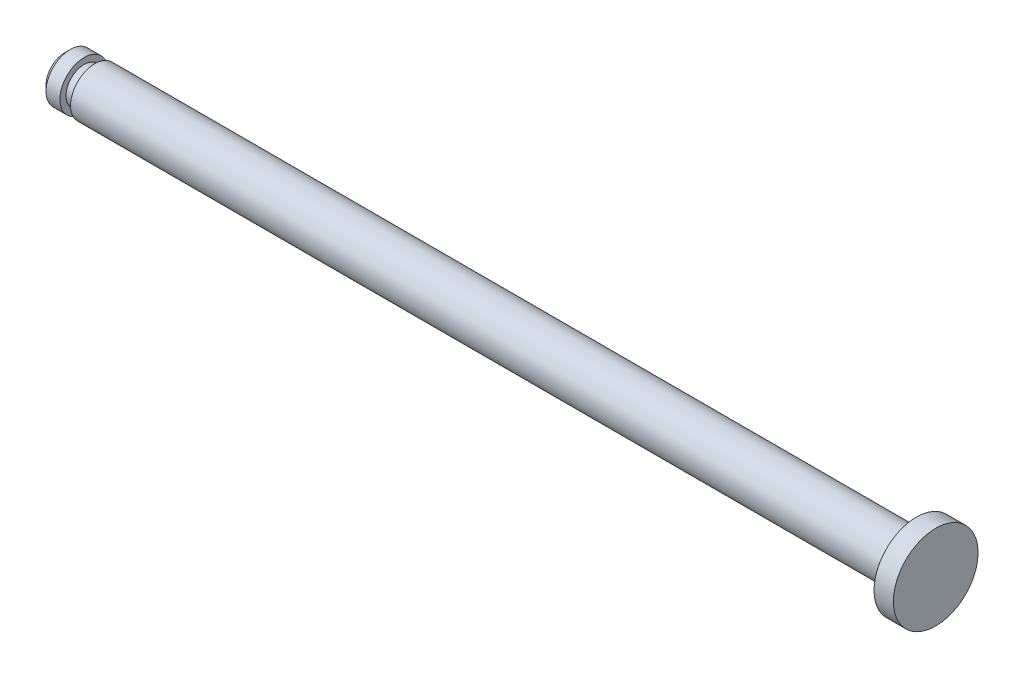
ISO-10303-21;
HEADER;
FILE_DESCRIPTION(('STEP AP214'),'2;1');
FILE_NAME('part.step','',(''),(''),'','','');
FILE_SCHEMA(('AUTOMOTIVE_DESIGN { 1 0 10303 214 1 1 1 1 }'));
ENDSEC;
DATA;
#1=APPLICATION_CONTEXT('core data for automotive mechanical design processes');
#2=APPLICATION_PROTOCOL_DEFINITION('international standard','automotive_design',2000,#1);
#3=PRODUCT_CONTEXT('',#1,'mechanical');
#4=PRODUCT('Part','Part','',(#3));
#5=PRODUCT_RELATED_PRODUCT_CATEGORY('part','',(#4));
#6=PRODUCT_DEFINITION_FORMATION('','',#4);
#7=PRODUCT_DEFINITION_CONTEXT('part definition',#1,'design');
#8=PRODUCT_DEFINITION('design','',#6,#7);
#9=PRODUCT_DEFINITION_SHAPE('','',#8);
#10=(LENGTH_UNIT() NAMED_UNIT(*) SI_UNIT(.MILLI.,.METRE.));
#11=(NAMED_UNIT(*) PLANE_ANGLE_UNIT() SI_UNIT($,.RADIAN.));
#12=(NAMED_UNIT(*) SI_UNIT($,.STERADIAN.) SOLID_ANGLE_UNIT());
#13=UNCERTAINTY_MEASURE_WITH_UNIT(LENGTH_MEASURE(1.E-05),#10,'distance_accuracy_value','');
#14=(GEOMETRIC_REPRESENTATION_CONTEXT(3) GLOBAL_UNCERTAINTY_ASSIGNED_CONTEXT((#13)) GLOBAL_UNIT_ASSIGNED_CONTEXT((#10,
#11,#12)) REPRESENTATION_CONTEXT('',''));
#15=CARTESIAN_POINT('',(0.,0.,0.));
#16=DIRECTION('',(0.,0.,1.));
#17=DIRECTION('',(1.,0.,0.));
#18=AXIS2_PLACEMENT_3D('',#15,#16,#17);
#19=CARTESIAN_POINT('',(-36.,0.,0.));
#20=DIRECTION('',(1.,0.,0.));
#21=DIRECTION('',(0.,0.,-1.));
#22=AXIS2_PLACEMENT_3D('',#19,#20,#21);
#23=PLANE('',#22);
#24=CARTESIAN_POINT('',(-36.,0.,0.));
#25=DIRECTION('',(-1.,0.,0.));
#26=DIRECTION('',(0.,0.,1.));
#27=AXIS2_PLACEMENT_3D('',#24,#25,#26);
#28=CIRCLE('',#27,0.77527582552831);
#29=CARTESIAN_POINT('',(-36.,0.,0.77527582552831));
#30=VERTEX_POINT('',#29);
#31=EDGE_CURVE('E10',#30,#30,#28,.T.);
#32=ORIENTED_EDGE('',*,*,#31,.T.);
#33=EDGE_LOOP('',(#32));
#34=FACE_BOUND('',#33,.T.);
#35=ADVANCED_FACE('F32',(#34),#23,.F.);
#36=CARTESIAN_POINT('',(-35.7752758255283,0.,0.));
#37=DIRECTION('',(1.,0.,0.));
#38=DIRECTION('',(0.,0.,-1.));
#39=AXIS2_PLACEMENT_3D('',#36,#37,#38);
#40=CONICAL_SURFACE('',#39,1.,0.785398163397464);
#41=ORIENTED_EDGE('',*,*,#31,.F.);
#42=EDGE_LOOP('',(#41));
#43=FACE_BOUND('',#42,.T.);
#44=CARTESIAN_POINT('',(-35.7752758255283,0.,0.));
#45=DIRECTION('',(-1.,0.,0.));
#46=DIRECTION('',(0.,0.,1.));
#47=AXIS2_PLACEMENT_3D('',#44,#45,#46);
#48=CIRCLE('',#47,1.);
#49=CARTESIAN_POINT('',(-35.7752758255283,0.,1.));
#50=VERTEX_POINT('',#49);
#51=EDGE_CURVE('E38',#50,#50,#48,.T.);
#52=ORIENTED_EDGE('',*,*,#51,.T.);
#53=EDGE_LOOP('',(#52));
#54=FACE_BOUND('',#53,.T.);
#55=ADVANCED_FACE('F79',(#43,#54),#40,.T.);
#56=CARTESIAN_POINT('',(-40.2814862387044,0.,0.));
#57=DIRECTION('',(-1.,0.,0.));
#58=DIRECTION('',(0.,0.,1.));
#59=AXIS2_PLACEMENT_3D('',#56,#57,#58);
#60=CYLINDRICAL_SURFACE('',#59,1.);
#61=ORIENTED_EDGE('',*,*,#51,.F.);
#62=EDGE_LOOP('',(#61));
#63=FACE_BOUND('',#62,.T.);
#64=CARTESIAN_POINT('',(-35.2,0.,0.));
#65=DIRECTION('',(-1.,0.,0.));
#66=DIRECTION('',(0.,0.,1.));
#67=AXIS2_PLACEMENT_3D('',#64,#65,#66);
#68=CIRCLE('',#67,1.);
#69=CARTESIAN_POINT('',(-35.2,0.,1.));
#70=VERTEX_POINT('',#69);
#71=EDGE_CURVE('E42',#70,#70,#68,.T.);
#72=ORIENTED_EDGE('',*,*,#71,.T.);
#73=EDGE_LOOP('',(#72));
#74=FACE_BOUND('',#73,.T.);
#75=ADVANCED_FACE('F83',(#63,#74),#60,.T.);
#76=CARTESIAN_POINT('',(-35.2,1.,0.));
#77=DIRECTION('',(-1.,0.,0.));
#78=DIRECTION('',(0.,0.,1.));
#79=AXIS2_PLACEMENT_3D('',#76,#77,#78);
#80=PLANE('',#79);
#81=ORIENTED_EDGE('',*,*,#71,.F.);
#82=EDGE_LOOP('',(#81));
#83=FACE_BOUND('',#82,.T.);
#84=CARTESIAN_POINT('',(-35.2,0.,0.));
#85=DIRECTION('',(-1.,0.,0.));
#86=DIRECTION('',(0.,0.,1.));
#87=AXIS2_PLACEMENT_3D('',#84,#85,#86);
#88=CIRCLE('',#87,0.75);
#89=CARTESIAN_POINT('',(-35.2,0.,0.75));
#90=VERTEX_POINT('',#89);
#91=EDGE_CURVE('E46',#90,#90,#88,.T.);
#92=ORIENTED_EDGE('',*,*,#91,.T.);
#93=EDGE_LOOP('',(#92));
#94=FACE_BOUND('',#93,.T.);
#95=ADVANCED_FACE('F88',(#83,#94),#80,.F.);
#96=CARTESIAN_POINT('',(-40.2814862387044,0.,0.));
#97=DIRECTION('',(-1.,0.,0.));
#98=DIRECTION('',(0.,0.,1.));
#99=AXIS2_PLACEMENT_3D('',#96,#97,#98);
#100=CYLINDRICAL_SURFACE('',#99,0.75);
#101=ORIENTED_EDGE('',*,*,#91,.F.);
#102=EDGE_LOOP('',(#101));
#103=FACE_BOUND('',#102,.T.);
#104=CARTESIAN_POINT('',(-34.76,0.,0.));
#105=DIRECTION('',(-1.,0.,0.));
#106=DIRECTION('',(0.,0.,1.));
#107=AXIS2_PLACEMENT_3D('',#104,#105,#106);
#108=CIRCLE('',#107,0.75);
#109=CARTESIAN_POINT('',(-34.76,0.,0.75));
#110=VERTEX_POINT('',#109);
#111=EDGE_CURVE('E51',#110,#110,#108,.T.);
#112=ORIENTED_EDGE('',*,*,#111,.T.);
#113=EDGE_LOOP('',(#112));
#114=FACE_BOUND('',#113,.T.);
#115=ADVANCED_FACE('F94',(#103,#114),#100,.T.);
#116=CARTESIAN_POINT('',(-34.76,0.75,0.));
#117=DIRECTION('',(1.,0.,0.));
#118=DIRECTION('',(0.,0.,-1.));
#119=AXIS2_PLACEMENT_3D('',#116,#117,#118);
#120=PLANE('',#119);
#121=ORIENTED_EDGE('',*,*,#111,.F.);
#122=EDGE_LOOP('',(#121));
#123=FACE_BOUND('',#122,.T.);
#124=CARTESIAN_POINT('',(-34.76,0.,0.));
#125=DIRECTION('',(-1.,0.,0.));
#126=DIRECTION('',(0.,0.,1.));
#127=AXIS2_PLACEMENT_3D('',#124,#125,#126);
#128=CIRCLE('',#127,1.);
#129=CARTESIAN_POINT('',(-34.76,0.,1.));
#130=VERTEX_POINT('',#129);
#131=EDGE_CURVE('E54',#130,#130,#128,.T.);
#132=ORIENTED_EDGE('',*,*,#131,.T.);
#133=EDGE_LOOP('',(#132));
#134=FACE_BOUND('',#133,.T.);
#135=ADVANCED_FACE('F98',(#123,#134),#120,.F.);
#136=CARTESIAN_POINT('',(-40.2814862387044,0.,0.));
#137=DIRECTION('',(-1.,0.,0.));
#138=DIRECTION('',(0.,0.,1.));
#139=AXIS2_PLACEMENT_3D('',#136,#137,#138);
#140=CYLINDRICAL_SURFACE('',#139,1.);
#141=ORIENTED_EDGE('',*,*,#131,.F.);
#142=EDGE_LOOP('',(#141));
#143=FACE_BOUND('',#142,.T.);
#144=CARTESIAN_POINT('',(-0.800000000000002,0.,0.));
#145=DIRECTION('',(-1.,0.,0.));
#146=DIRECTION('',(0.,0.,1.));
#147=AXIS2_PLACEMENT_3D('',#144,#145,#146);
#148=CIRCLE('',#147,1.);
#149=CARTESIAN_POINT('',(-0.800000000000002,0.,1.));
#150=VERTEX_POINT('',#149);
#151=EDGE_CURVE('E57',#150,#150,#148,.T.);
#152=ORIENTED_EDGE('',*,*,#151,.T.);
#153=EDGE_LOOP('',(#152));
#154=FACE_BOUND('',#153,.T.);
#155=ADVANCED_FACE('F102',(#143,#154),#140,.T.);
#156=CARTESIAN_POINT('',(-0.8,1.,0.));
#157=DIRECTION('',(1.,0.,0.));
#158=DIRECTION('',(0.,0.,-1.));
#159=AXIS2_PLACEMENT_3D('',#156,#157,#158);
#160=PLANE('',#159);
#161=ORIENTED_EDGE('',*,*,#151,.F.);
#162=EDGE_LOOP('',(#161));
#163=FACE_BOUND('',#162,.T.);
#164=CARTESIAN_POINT('',(-0.800000000000002,0.,0.));
#165=DIRECTION('',(-1.,0.,0.));
#166=DIRECTION('',(0.,0.,1.));
#167=AXIS2_PLACEMENT_3D('',#164,#165,#166);
#168=CIRCLE('',#167,1.75);
#169=CARTESIAN_POINT('',(-0.800000000000002,0.,1.75));
#170=VERTEX_POINT('',#169);
#171=EDGE_CURVE('E60',#170,#170,#168,.T.);
#172=ORIENTED_EDGE('',*,*,#171,.T.);
#173=EDGE_LOOP('',(#172));
#174=FACE_BOUND('',#173,.T.);
#175=ADVANCED_FACE('F75',(#163,#174),#160,.F.);
#176=CARTESIAN_POINT('',(-40.2814862387044,0.,0.));
#177=DIRECTION('',(-1.,0.,0.));
#178=DIRECTION('',(0.,0.,1.));
#179=AXIS2_PLACEMENT_3D('',#176,#177,#178);
#180=CYLINDRICAL_SURFACE('',#179,1.75);
#181=ORIENTED_EDGE('',*,*,#171,.F.);
#182=EDGE_LOOP('',(#181));
#183=FACE_BOUND('',#182,.T.);
#184=CARTESIAN_POINT('',(0.,0.,0.));
#185=DIRECTION('',(-1.,0.,0.));
#186=DIRECTION('',(0.,0.,1.));
#187=AXIS2_PLACEMENT_3D('',#184,#185,#186);
#188=CIRCLE('',#187,1.75);
#189=CARTESIAN_POINT('',(0.,0.,1.75));
#190=VERTEX_POINT('',#189);
#191=EDGE_CURVE('E63',#190,#190,#188,.T.);
#192=ORIENTED_EDGE('',*,*,#191,.T.);
#193=EDGE_LOOP('',(#192));
#194=FACE_BOUND('',#193,.T.);
#195=ADVANCED_FACE('F67',(#183,#194),#180,.T.);
#196=CARTESIAN_POINT('',(0.,1.75,0.));
#197=DIRECTION('',(-1.,0.,0.));
#198=DIRECTION('',(0.,0.,1.));
#199=AXIS2_PLACEMENT_3D('',#196,#197,#198);
#200=PLANE('',#199);
#201=ORIENTED_EDGE('',*,*,#191,.F.);
#202=EDGE_LOOP('',(#201));
#203=FACE_BOUND('',#202,.T.);
#204=ADVANCED_FACE('F69',(#203),#200,.F.);
#205=CLOSED_SHELL('',(#35,#55,#75,#95,#115,#135,#155,#175,#195,#204));
#206=MANIFOLD_SOLID_BREP('B2',#205);
#207=ADVANCED_BREP_SHAPE_REPRESENTATION('',(#18,#206),#14);
#208=SHAPE_DEFINITION_REPRESENTATION(#9,#207);
ENDSEC;
END-ISO-10303-21;
